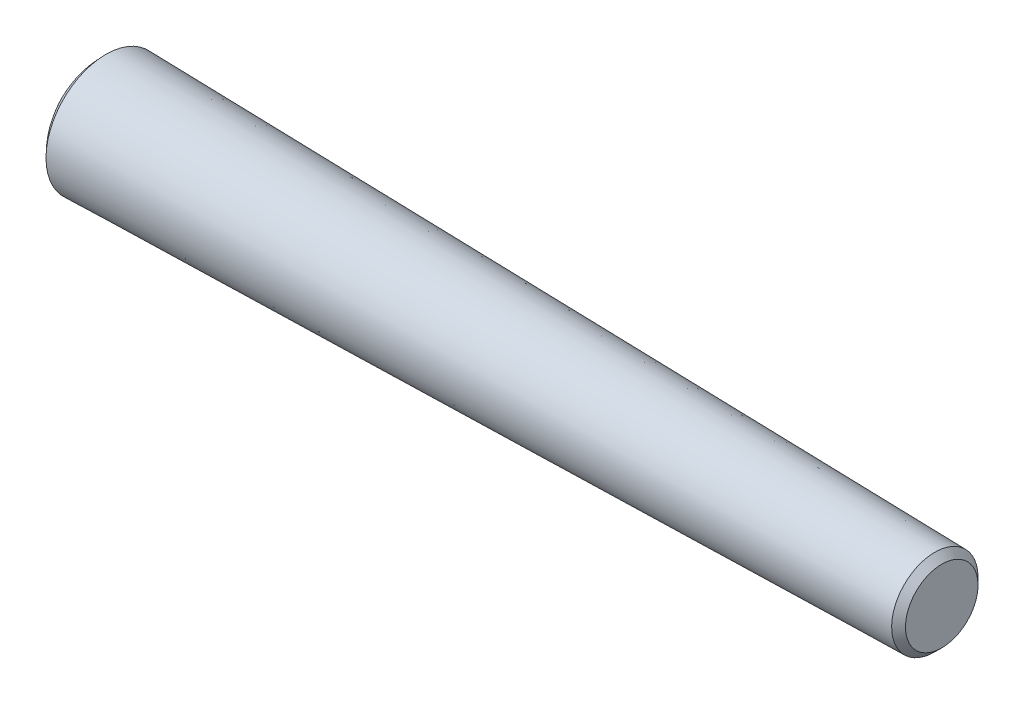
ISO-10303-21;
HEADER;
FILE_DESCRIPTION(('STEP AP214'),'2;1');
FILE_NAME('part.step','',(''),(''),'','','');
FILE_SCHEMA(('AUTOMOTIVE_DESIGN { 1 0 10303 214 1 1 1 1 }'));
ENDSEC;
DATA;
#1=APPLICATION_CONTEXT('core data for automotive mechanical design processes');
#2=APPLICATION_PROTOCOL_DEFINITION('international standard','automotive_design',2000,#1);
#3=PRODUCT_CONTEXT('',#1,'mechanical');
#4=PRODUCT('Part','Part','',(#3));
#5=PRODUCT_RELATED_PRODUCT_CATEGORY('part','',(#4));
#6=PRODUCT_DEFINITION_FORMATION('','',#4);
#7=PRODUCT_DEFINITION_CONTEXT('part definition',#1,'design');
#8=PRODUCT_DEFINITION('design','',#6,#7);
#9=PRODUCT_DEFINITION_SHAPE('','',#8);
#10=(LENGTH_UNIT() NAMED_UNIT(*) SI_UNIT(.MILLI.,.METRE.));
#11=(NAMED_UNIT(*) PLANE_ANGLE_UNIT() SI_UNIT($,.RADIAN.));
#12=(NAMED_UNIT(*) SI_UNIT($,.STERADIAN.) SOLID_ANGLE_UNIT());
#13=UNCERTAINTY_MEASURE_WITH_UNIT(LENGTH_MEASURE(1.E-05),#10,'distance_accuracy_value','');
#14=(GEOMETRIC_REPRESENTATION_CONTEXT(3) GLOBAL_UNCERTAINTY_ASSIGNED_CONTEXT((#13)) GLOBAL_UNIT_ASSIGNED_CONTEXT((#10,
#11,#12)) REPRESENTATION_CONTEXT('',''));
#15=CARTESIAN_POINT('',(0.,0.,0.));
#16=DIRECTION('',(0.,0.,1.));
#17=DIRECTION('',(1.,0.,0.));
#18=AXIS2_PLACEMENT_3D('',#15,#16,#17);
#19=CARTESIAN_POINT('',(0.83080583960588,0.,0.));
#20=DIRECTION('',(-1.,0.,0.));
#21=DIRECTION('',(0.,1.,0.));
#22=AXIS2_PLACEMENT_3D('',#19,#20,#21);
#23=SPHERICAL_SURFACE('',#22,1.2);
#24=CARTESIAN_POINT('',(0.,0.,0.));
#25=DIRECTION('',(-1.,0.,0.));
#26=DIRECTION('',(0.,-1.,0.));
#27=AXIS2_PLACEMENT_3D('',#24,#25,#26);
#28=CIRCLE('',#27,0.865887785383747);
#29=CARTESIAN_POINT('',(0.,-0.865887785383747,0.));
#30=VERTEX_POINT('',#29);
#31=EDGE_CURVE('E53',#30,#30,#28,.T.);
#32=ORIENTED_EDGE('',*,*,#31,.T.);
#33=EDGE_LOOP('',(#32));
#34=FACE_BOUND('',#33,.T.);
#35=ADVANCED_FACE('F43',(#34),#23,.T.);
#36=CARTESIAN_POINT('',(12.1,0.525,0.));
#37=DIRECTION('',(-1.,0.,0.));
#38=DIRECTION('',(0.,-1.,0.));
#39=AXIS2_PLACEMENT_3D('',#36,#37,#38);
#40=PLANE('',#39);
#41=CARTESIAN_POINT('',(12.1,0.,0.));
#42=DIRECTION('',(-1.,0.,0.));
#43=DIRECTION('',(0.,-1.,0.));
#44=AXIS2_PLACEMENT_3D('',#41,#42,#43);
#45=CIRCLE('',#44,0.525);
#46=CARTESIAN_POINT('',(12.1,-0.525,0.));
#47=VERTEX_POINT('',#46);
#48=EDGE_CURVE('E12',#47,#47,#45,.T.);
#49=ORIENTED_EDGE('',*,*,#48,.F.);
#50=EDGE_LOOP('',(#49));
#51=FACE_BOUND('',#50,.T.);
#52=ADVANCED_FACE('F68',(#51),#40,.F.);
#53=CARTESIAN_POINT('',(12.1,0.,0.));
#54=DIRECTION('',(-1.,0.,0.));
#55=DIRECTION('',(0.,-1.,0.));
#56=AXIS2_PLACEMENT_3D('',#53,#54,#55);
#57=CONICAL_SURFACE('',#56,0.525,0.78539816339745);
#58=CARTESIAN_POINT('',(12.,0.,0.));
#59=DIRECTION('',(-1.,0.,0.));
#60=DIRECTION('',(0.,-1.,0.));
#61=AXIS2_PLACEMENT_3D('',#58,#59,#60);
#62=CIRCLE('',#61,0.625);
#63=CARTESIAN_POINT('',(12.,-0.625,0.));
#64=VERTEX_POINT('',#63);
#65=EDGE_CURVE('E49',#64,#64,#62,.T.);
#66=ORIENTED_EDGE('',*,*,#65,.F.);
#67=EDGE_LOOP('',(#66));
#68=FACE_BOUND('',#67,.T.);
#69=ORIENTED_EDGE('',*,*,#48,.T.);
#70=EDGE_LOOP('',(#69));
#71=FACE_BOUND('',#70,.T.);
#72=ADVANCED_FACE('F63',(#68,#71),#57,.T.);
#73=CARTESIAN_POINT('',(12.,0.,0.));
#74=DIRECTION('',(-1.,0.,0.));
#75=DIRECTION('',(0.,-1.,0.));
#76=AXIS2_PLACEMENT_3D('',#73,#74,#75);
#77=CONICAL_SURFACE('',#76,0.625,0.0200712863979348);
#78=ORIENTED_EDGE('',*,*,#31,.F.);
#79=EDGE_LOOP('',(#78));
#80=FACE_BOUND('',#79,.T.);
#81=ORIENTED_EDGE('',*,*,#65,.T.);
#82=EDGE_LOOP('',(#81));
#83=FACE_BOUND('',#82,.T.);
#84=ADVANCED_FACE('F61',(#80,#83),#77,.T.);
#85=CLOSED_SHELL('',(#35,#52,#72,#84));
#86=MANIFOLD_SOLID_BREP('B2',#85);
#87=ADVANCED_BREP_SHAPE_REPRESENTATION('',(#18,#86),#14);
#88=SHAPE_DEFINITION_REPRESENTATION(#9,#87);
ENDSEC;
END-ISO-10303-21;
